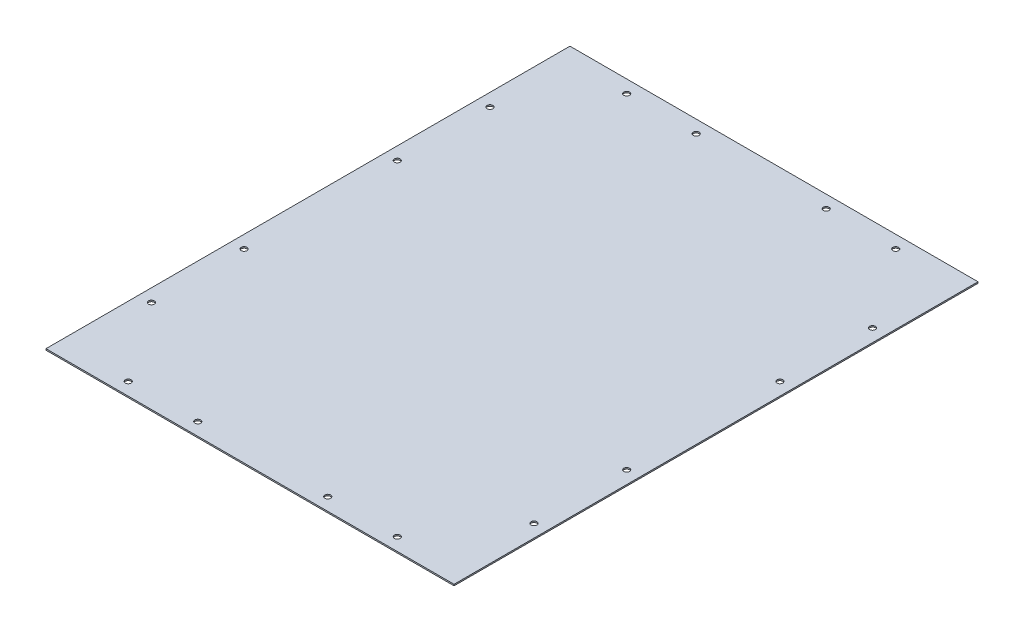
ISO-10303-21;
HEADER;
FILE_DESCRIPTION(('STEP AP214'),'2;1');
FILE_NAME('part.step','',(''),(''),'','','');
FILE_SCHEMA(('AUTOMOTIVE_DESIGN { 1 0 10303 214 1 1 1 1 }'));
ENDSEC;
DATA;
#1=APPLICATION_CONTEXT('core data for automotive mechanical design processes');
#2=APPLICATION_PROTOCOL_DEFINITION('international standard','automotive_design',2000,#1);
#3=PRODUCT_CONTEXT('',#1,'mechanical');
#4=PRODUCT('Part','Part','',(#3));
#5=PRODUCT_RELATED_PRODUCT_CATEGORY('part','',(#4));
#6=PRODUCT_DEFINITION_FORMATION('','',#4);
#7=PRODUCT_DEFINITION_CONTEXT('part definition',#1,'design');
#8=PRODUCT_DEFINITION('design','',#6,#7);
#9=PRODUCT_DEFINITION_SHAPE('','',#8);
#10=(LENGTH_UNIT() NAMED_UNIT(*) SI_UNIT(.MILLI.,.METRE.));
#11=(NAMED_UNIT(*) PLANE_ANGLE_UNIT() SI_UNIT($,.RADIAN.));
#12=(NAMED_UNIT(*) SI_UNIT($,.STERADIAN.) SOLID_ANGLE_UNIT());
#13=UNCERTAINTY_MEASURE_WITH_UNIT(LENGTH_MEASURE(1.E-05),#10,'distance_accuracy_value','');
#14=(GEOMETRIC_REPRESENTATION_CONTEXT(3) GLOBAL_UNCERTAINTY_ASSIGNED_CONTEXT((#13)) GLOBAL_UNIT_ASSIGNED_CONTEXT((#10,
#11,#12)) REPRESENTATION_CONTEXT('',''));
#15=CARTESIAN_POINT('',(0.,0.,0.));
#16=DIRECTION('',(0.,0.,1.));
#17=DIRECTION('',(1.,0.,0.));
#18=AXIS2_PLACEMENT_3D('',#15,#16,#17);
#19=CARTESIAN_POINT('',(0.,0.,0.));
#20=DIRECTION('',(-1.,0.,0.));
#21=DIRECTION('',(0.,0.,-1.));
#22=AXIS2_PLACEMENT_3D('',#19,#20,#21);
#23=PLANE('',#22);
#24=DIRECTION('',(0.,-1.,0.));
#25=VECTOR('',#24,1.);
#26=CARTESIAN_POINT('',(0.,0.,0.));
#27=LINE('',#26,#25);
#28=CARTESIAN_POINT('',(0.,1.2,0.));
#29=VERTEX_POINT('',#28);
#30=CARTESIAN_POINT('',(0.,0.,0.));
#31=VERTEX_POINT('',#30);
#32=EDGE_CURVE('E11',#29,#31,#27,.T.);
#33=ORIENTED_EDGE('',*,*,#32,.F.);
#34=DIRECTION('',(0.,0.,-1.));
#35=VECTOR('',#34,1.);
#36=CARTESIAN_POINT('',(0.,1.2,0.));
#37=LINE('',#36,#35);
#38=CARTESIAN_POINT('',(0.,1.2,-452.2));
#39=VERTEX_POINT('',#38);
#40=EDGE_CURVE('E71',#29,#39,#37,.T.);
#41=ORIENTED_EDGE('',*,*,#40,.T.);
#42=DIRECTION('',(0.,-1.,0.));
#43=VECTOR('',#42,1.);
#44=CARTESIAN_POINT('',(0.,0.,-452.2));
#45=LINE('',#44,#43);
#46=CARTESIAN_POINT('',(0.,0.,-452.2));
#47=VERTEX_POINT('',#46);
#48=EDGE_CURVE('E47',#39,#47,#45,.T.);
#49=ORIENTED_EDGE('',*,*,#48,.T.);
#50=DIRECTION('',(0.,0.,-1.));
#51=VECTOR('',#50,1.);
#52=CARTESIAN_POINT('',(0.,0.,0.));
#53=LINE('',#52,#51);
#54=EDGE_CURVE('E73',#31,#47,#53,.T.);
#55=ORIENTED_EDGE('',*,*,#54,.F.);
#56=EDGE_LOOP('',(#33,#41,#49,#55));
#57=FACE_BOUND('',#56,.T.);
#58=ADVANCED_FACE('F37',(#57),#23,.T.);
#59=CARTESIAN_POINT('',(0.,0.,-452.2));
#60=DIRECTION('',(0.,0.,-1.));
#61=DIRECTION('',(1.,0.,0.));
#62=AXIS2_PLACEMENT_3D('',#59,#60,#61);
#63=PLANE('',#62);
#64=ORIENTED_EDGE('',*,*,#48,.F.);
#65=DIRECTION('',(1.,0.,0.));
#66=VECTOR('',#65,1.);
#67=CARTESIAN_POINT('',(0.,1.2,-452.2));
#68=LINE('',#67,#66);
#69=CARTESIAN_POINT('',(352.2,1.2,-452.2));
#70=VERTEX_POINT('',#69);
#71=EDGE_CURVE('E85',#39,#70,#68,.T.);
#72=ORIENTED_EDGE('',*,*,#71,.T.);
#73=DIRECTION('',(0.,-1.,0.));
#74=VECTOR('',#73,1.);
#75=CARTESIAN_POINT('',(352.2,0.,-452.2));
#76=LINE('',#75,#74);
#77=CARTESIAN_POINT('',(352.2,0.,-452.2));
#78=VERTEX_POINT('',#77);
#79=EDGE_CURVE('E94',#70,#78,#76,.T.);
#80=ORIENTED_EDGE('',*,*,#79,.T.);
#81=DIRECTION('',(1.,0.,0.));
#82=VECTOR('',#81,1.);
#83=CARTESIAN_POINT('',(0.,0.,-452.2));
#84=LINE('',#83,#82);
#85=EDGE_CURVE('E99',#47,#78,#84,.T.);
#86=ORIENTED_EDGE('',*,*,#85,.F.);
#87=EDGE_LOOP('',(#64,#72,#80,#86));
#88=FACE_BOUND('',#87,.T.);
#89=ADVANCED_FACE('F112',(#88),#63,.T.);
#90=CARTESIAN_POINT('',(352.2,0.,0.));
#91=DIRECTION('',(-1.,0.,0.));
#92=DIRECTION('',(0.,0.,-1.));
#93=AXIS2_PLACEMENT_3D('',#90,#91,#92);
#94=PLANE('',#93);
#95=ORIENTED_EDGE('',*,*,#79,.F.);
#96=DIRECTION('',(0.,0.,-1.));
#97=VECTOR('',#96,1.);
#98=CARTESIAN_POINT('',(352.2,1.2,0.));
#99=LINE('',#98,#97);
#100=CARTESIAN_POINT('',(352.2,1.2,0.));
#101=VERTEX_POINT('',#100);
#102=EDGE_CURVE('E88',#101,#70,#99,.T.);
#103=ORIENTED_EDGE('',*,*,#102,.F.);
#104=DIRECTION('',(0.,-1.,0.));
#105=VECTOR('',#104,1.);
#106=CARTESIAN_POINT('',(352.2,0.,0.));
#107=LINE('',#106,#105);
#108=CARTESIAN_POINT('',(352.2,0.,0.));
#109=VERTEX_POINT('',#108);
#110=EDGE_CURVE('E41',#101,#109,#107,.T.);
#111=ORIENTED_EDGE('',*,*,#110,.T.);
#112=DIRECTION('',(0.,0.,-1.));
#113=VECTOR('',#112,1.);
#114=CARTESIAN_POINT('',(352.2,0.,0.));
#115=LINE('',#114,#113);
#116=EDGE_CURVE('E109',#109,#78,#115,.T.);
#117=ORIENTED_EDGE('',*,*,#116,.T.);
#118=EDGE_LOOP('',(#95,#103,#111,#117));
#119=FACE_BOUND('',#118,.T.);
#120=ADVANCED_FACE('F110',(#119),#94,.F.);
#121=CARTESIAN_POINT('',(0.,0.,0.));
#122=DIRECTION('',(0.,0.,-1.));
#123=DIRECTION('',(1.,0.,0.));
#124=AXIS2_PLACEMENT_3D('',#121,#122,#123);
#125=PLANE('',#124);
#126=DIRECTION('',(1.,0.,0.));
#127=VECTOR('',#126,1.);
#128=CARTESIAN_POINT('',(0.,1.2,0.));
#129=LINE('',#128,#127);
#130=EDGE_CURVE('E82',#29,#101,#129,.T.);
#131=ORIENTED_EDGE('',*,*,#130,.F.);
#132=ORIENTED_EDGE('',*,*,#32,.T.);
#133=DIRECTION('',(1.,0.,0.));
#134=VECTOR('',#133,1.);
#135=CARTESIAN_POINT('',(0.,0.,0.));
#136=LINE('',#135,#134);
#137=EDGE_CURVE('E105',#31,#109,#136,.T.);
#138=ORIENTED_EDGE('',*,*,#137,.T.);
#139=ORIENTED_EDGE('',*,*,#110,.F.);
#140=EDGE_LOOP('',(#131,#132,#138,#139));
#141=FACE_BOUND('',#140,.T.);
#142=ADVANCED_FACE('F39',(#141),#125,.F.);
#143=CARTESIAN_POINT('',(0.,0.,0.));
#144=DIRECTION('',(0.,-1.,0.));
#145=DIRECTION('',(0.,0.,-1.));
#146=AXIS2_PLACEMENT_3D('',#143,#144,#145);
#147=PLANE('',#146);
#148=CARTESIAN_POINT('',(11.,0.,-160.));
#149=DIRECTION('',(0.,-1.,0.));
#150=DIRECTION('',(0.,0.,-1.));
#151=AXIS2_PLACEMENT_3D('',#148,#149,#150);
#152=CIRCLE('',#151,2.5);
#153=CARTESIAN_POINT('',(11.,0.,-162.5));
#154=VERTEX_POINT('',#153);
#155=EDGE_CURVE('E90',#154,#154,#152,.T.);
#156=ORIENTED_EDGE('',*,*,#155,.F.);
#157=EDGE_LOOP('',(#156));
#158=FACE_BOUND('',#157,.T.);
#159=CARTESIAN_POINT('',(232.2,0.,-441.2));
#160=DIRECTION('',(0.,-1.,0.));
#161=DIRECTION('',(0.,0.,-1.));
#162=AXIS2_PLACEMENT_3D('',#159,#160,#161);
#163=CIRCLE('',#162,2.5);
#164=CARTESIAN_POINT('',(232.2,0.,-443.7));
#165=VERTEX_POINT('',#164);
#166=EDGE_CURVE('E287',#165,#165,#163,.T.);
#167=ORIENTED_EDGE('',*,*,#166,.F.);
#168=EDGE_LOOP('',(#167));
#169=FACE_BOUND('',#168,.T.);
#170=CARTESIAN_POINT('',(292.2,0.,-441.2));
#171=DIRECTION('',(0.,-1.,0.));
#172=DIRECTION('',(0.,0.,-1.));
#173=AXIS2_PLACEMENT_3D('',#170,#171,#172);
#174=CIRCLE('',#173,2.49999999999997);
#175=CARTESIAN_POINT('',(292.2,0.,-443.7));
#176=VERTEX_POINT('',#175);
#177=EDGE_CURVE('E284',#176,#176,#174,.T.);
#178=ORIENTED_EDGE('',*,*,#177,.F.);
#179=EDGE_LOOP('',(#178));
#180=FACE_BOUND('',#179,.T.);
#181=CARTESIAN_POINT('',(341.2,0.,-372.2));
#182=DIRECTION('',(0.,-1.,0.));
#183=DIRECTION('',(0.,0.,-1.));
#184=AXIS2_PLACEMENT_3D('',#181,#182,#183);
#185=CIRCLE('',#184,2.50000000000002);
#186=CARTESIAN_POINT('',(341.2,0.,-374.7));
#187=VERTEX_POINT('',#186);
#188=EDGE_CURVE('E281',#187,#187,#185,.T.);
#189=ORIENTED_EDGE('',*,*,#188,.F.);
#190=EDGE_LOOP('',(#189));
#191=FACE_BOUND('',#190,.T.);
#192=CARTESIAN_POINT('',(341.2,0.,-292.2));
#193=DIRECTION('',(0.,-1.,0.));
#194=DIRECTION('',(0.,0.,-1.));
#195=AXIS2_PLACEMENT_3D('',#192,#193,#194);
#196=CIRCLE('',#195,2.50000000000002);
#197=CARTESIAN_POINT('',(341.2,0.,-294.7));
#198=VERTEX_POINT('',#197);
#199=EDGE_CURVE('E278',#198,#198,#196,.T.);
#200=ORIENTED_EDGE('',*,*,#199,.F.);
#201=EDGE_LOOP('',(#200));
#202=FACE_BOUND('',#201,.T.);
#203=CARTESIAN_POINT('',(11.,0.,-292.2));
#204=DIRECTION('',(0.,-1.,0.));
#205=DIRECTION('',(0.,0.,-1.));
#206=AXIS2_PLACEMENT_3D('',#203,#204,#205);
#207=CIRCLE('',#206,2.5);
#208=CARTESIAN_POINT('',(11.,0.,-294.7));
#209=VERTEX_POINT('',#208);
#210=EDGE_CURVE('E275',#209,#209,#207,.T.);
#211=ORIENTED_EDGE('',*,*,#210,.F.);
#212=EDGE_LOOP('',(#211));
#213=FACE_BOUND('',#212,.T.);
#214=CARTESIAN_POINT('',(11.,0.,-372.2));
#215=DIRECTION('',(0.,-1.,0.));
#216=DIRECTION('',(0.,0.,-1.));
#217=AXIS2_PLACEMENT_3D('',#214,#215,#216);
#218=CIRCLE('',#217,2.5);
#219=CARTESIAN_POINT('',(11.,0.,-374.7));
#220=VERTEX_POINT('',#219);
#221=EDGE_CURVE('E272',#220,#220,#218,.T.);
#222=ORIENTED_EDGE('',*,*,#221,.F.);
#223=EDGE_LOOP('',(#222));
#224=FACE_BOUND('',#223,.T.);
#225=CARTESIAN_POINT('',(120.,0.,-441.2));
#226=DIRECTION('',(0.,-1.,0.));
#227=DIRECTION('',(0.,0.,-1.));
#228=AXIS2_PLACEMENT_3D('',#225,#226,#227);
#229=CIRCLE('',#228,2.5);
#230=CARTESIAN_POINT('',(120.,0.,-443.7));
#231=VERTEX_POINT('',#230);
#232=EDGE_CURVE('E269',#231,#231,#229,.T.);
#233=ORIENTED_EDGE('',*,*,#232,.F.);
#234=EDGE_LOOP('',(#233));
#235=FACE_BOUND('',#234,.T.);
#236=CARTESIAN_POINT('',(11.,0.,-80.));
#237=DIRECTION('',(0.,-1.,0.));
#238=DIRECTION('',(0.,0.,-1.));
#239=AXIS2_PLACEMENT_3D('',#236,#237,#238);
#240=CIRCLE('',#239,2.5);
#241=CARTESIAN_POINT('',(11.,0.,-82.5));
#242=VERTEX_POINT('',#241);
#243=EDGE_CURVE('E195',#242,#242,#240,.T.);
#244=ORIENTED_EDGE('',*,*,#243,.F.);
#245=EDGE_LOOP('',(#244));
#246=FACE_BOUND('',#245,.T.);
#247=CARTESIAN_POINT('',(60.,0.,-10.9999999999999));
#248=DIRECTION('',(0.,-1.,0.));
#249=DIRECTION('',(0.,0.,-1.));
#250=AXIS2_PLACEMENT_3D('',#247,#248,#249);
#251=CIRCLE('',#250,2.5);
#252=CARTESIAN_POINT('',(60.,0.,-13.4999999999999));
#253=VERTEX_POINT('',#252);
#254=EDGE_CURVE('E265',#253,#253,#251,.T.);
#255=ORIENTED_EDGE('',*,*,#254,.F.);
#256=EDGE_LOOP('',(#255));
#257=FACE_BOUND('',#256,.T.);
#258=CARTESIAN_POINT('',(120.,0.,-10.9999999999999));
#259=DIRECTION('',(0.,-1.,0.));
#260=DIRECTION('',(0.,0.,-1.));
#261=AXIS2_PLACEMENT_3D('',#258,#259,#260);
#262=CIRCLE('',#261,2.5);
#263=CARTESIAN_POINT('',(120.,0.,-13.4999999999999));
#264=VERTEX_POINT('',#263);
#265=EDGE_CURVE('E262',#264,#264,#262,.T.);
#266=ORIENTED_EDGE('',*,*,#265,.F.);
#267=EDGE_LOOP('',(#266));
#268=FACE_BOUND('',#267,.T.);
#269=CARTESIAN_POINT('',(232.2,0.,-10.9999999999999));
#270=DIRECTION('',(0.,-1.,0.));
#271=DIRECTION('',(0.,0.,-1.));
#272=AXIS2_PLACEMENT_3D('',#269,#270,#271);
#273=CIRCLE('',#272,2.5);
#274=CARTESIAN_POINT('',(232.2,0.,-13.4999999999999));
#275=VERTEX_POINT('',#274);
#276=EDGE_CURVE('E259',#275,#275,#273,.T.);
#277=ORIENTED_EDGE('',*,*,#276,.F.);
#278=EDGE_LOOP('',(#277));
#279=FACE_BOUND('',#278,.T.);
#280=CARTESIAN_POINT('',(292.2,0.,-10.9999999999999));
#281=DIRECTION('',(0.,-1.,0.));
#282=DIRECTION('',(0.,0.,-1.));
#283=AXIS2_PLACEMENT_3D('',#280,#281,#282);
#284=CIRCLE('',#283,2.49999999999997);
#285=CARTESIAN_POINT('',(292.2,0.,-13.4999999999999));
#286=VERTEX_POINT('',#285);
#287=EDGE_CURVE('E256',#286,#286,#284,.T.);
#288=ORIENTED_EDGE('',*,*,#287,.F.);
#289=EDGE_LOOP('',(#288));
#290=FACE_BOUND('',#289,.T.);
#291=CARTESIAN_POINT('',(341.2,0.,-80.0000000000001));
#292=DIRECTION('',(0.,-1.,0.));
#293=DIRECTION('',(0.,0.,-1.));
#294=AXIS2_PLACEMENT_3D('',#291,#292,#293);
#295=CIRCLE('',#294,2.50000000000002);
#296=CARTESIAN_POINT('',(341.2,0.,-82.5000000000001));
#297=VERTEX_POINT('',#296);
#298=EDGE_CURVE('E253',#297,#297,#295,.T.);
#299=ORIENTED_EDGE('',*,*,#298,.F.);
#300=EDGE_LOOP('',(#299));
#301=FACE_BOUND('',#300,.T.);
#302=CARTESIAN_POINT('',(341.2,0.,-160.));
#303=DIRECTION('',(0.,-1.,0.));
#304=DIRECTION('',(0.,0.,-1.));
#305=AXIS2_PLACEMENT_3D('',#302,#303,#304);
#306=CIRCLE('',#305,2.50000000000002);
#307=CARTESIAN_POINT('',(341.2,0.,-162.5));
#308=VERTEX_POINT('',#307);
#309=EDGE_CURVE('E250',#308,#308,#306,.T.);
#310=ORIENTED_EDGE('',*,*,#309,.F.);
#311=EDGE_LOOP('',(#310));
#312=FACE_BOUND('',#311,.T.);
#313=CARTESIAN_POINT('',(60.,0.,-441.2));
#314=DIRECTION('',(0.,-1.,0.));
#315=DIRECTION('',(0.,0.,-1.));
#316=AXIS2_PLACEMENT_3D('',#313,#314,#315);
#317=CIRCLE('',#316,2.5);
#318=CARTESIAN_POINT('',(60.,0.,-443.7));
#319=VERTEX_POINT('',#318);
#320=EDGE_CURVE('E247',#319,#319,#317,.T.);
#321=ORIENTED_EDGE('',*,*,#320,.F.);
#322=EDGE_LOOP('',(#321));
#323=FACE_BOUND('',#322,.T.);
#324=ORIENTED_EDGE('',*,*,#116,.F.);
#325=ORIENTED_EDGE('',*,*,#137,.F.);
#326=ORIENTED_EDGE('',*,*,#54,.T.);
#327=ORIENTED_EDGE('',*,*,#85,.T.);
#328=EDGE_LOOP('',(#324,#325,#326,#327));
#329=FACE_BOUND('',#328,.T.);
#330=ADVANCED_FACE('F111',(#158,#169,#180,#191,#202,#213,#224,#235,#246,#257,#268,#279,#290,
#301,#312,#323,#329),#147,.T.);
#331=CARTESIAN_POINT('',(0.,1.2,0.));
#332=DIRECTION('',(0.,-1.,0.));
#333=DIRECTION('',(0.,0.,-1.));
#334=AXIS2_PLACEMENT_3D('',#331,#332,#333);
#335=PLANE('',#334);
#336=CARTESIAN_POINT('',(11.,1.2,-160.));
#337=DIRECTION('',(0.,1.,0.));
#338=DIRECTION('',(0.,0.,-1.));
#339=AXIS2_PLACEMENT_3D('',#336,#337,#338);
#340=CIRCLE('',#339,2.5);
#341=CARTESIAN_POINT('',(11.,1.2,-162.5));
#342=VERTEX_POINT('',#341);
#343=EDGE_CURVE('E200',#342,#342,#340,.T.);
#344=ORIENTED_EDGE('',*,*,#343,.F.);
#345=EDGE_LOOP('',(#344));
#346=FACE_BOUND('',#345,.T.);
#347=CARTESIAN_POINT('',(232.2,1.2,-441.2));
#348=DIRECTION('',(0.,1.,0.));
#349=DIRECTION('',(0.,0.,-1.));
#350=AXIS2_PLACEMENT_3D('',#347,#348,#349);
#351=CIRCLE('',#350,2.5);
#352=CARTESIAN_POINT('',(232.2,1.2,-443.7));
#353=VERTEX_POINT('',#352);
#354=EDGE_CURVE('E204',#353,#353,#351,.T.);
#355=ORIENTED_EDGE('',*,*,#354,.F.);
#356=EDGE_LOOP('',(#355));
#357=FACE_BOUND('',#356,.T.);
#358=CARTESIAN_POINT('',(292.2,1.2,-441.2));
#359=DIRECTION('',(0.,1.,0.));
#360=DIRECTION('',(0.,0.,-1.));
#361=AXIS2_PLACEMENT_3D('',#358,#359,#360);
#362=CIRCLE('',#361,2.49999999999997);
#363=CARTESIAN_POINT('',(292.2,1.2,-443.7));
#364=VERTEX_POINT('',#363);
#365=EDGE_CURVE('E228',#364,#364,#362,.T.);
#366=ORIENTED_EDGE('',*,*,#365,.F.);
#367=EDGE_LOOP('',(#366));
#368=FACE_BOUND('',#367,.T.);
#369=CARTESIAN_POINT('',(341.2,1.2,-372.2));
#370=DIRECTION('',(0.,1.,0.));
#371=DIRECTION('',(0.,0.,-1.));
#372=AXIS2_PLACEMENT_3D('',#369,#370,#371);
#373=CIRCLE('',#372,2.50000000000002);
#374=CARTESIAN_POINT('',(341.2,1.2,-374.7));
#375=VERTEX_POINT('',#374);
#376=EDGE_CURVE('E224',#375,#375,#373,.T.);
#377=ORIENTED_EDGE('',*,*,#376,.F.);
#378=EDGE_LOOP('',(#377));
#379=FACE_BOUND('',#378,.T.);
#380=CARTESIAN_POINT('',(341.2,1.2,-292.2));
#381=DIRECTION('',(0.,1.,0.));
#382=DIRECTION('',(0.,0.,-1.));
#383=AXIS2_PLACEMENT_3D('',#380,#381,#382);
#384=CIRCLE('',#383,2.50000000000002);
#385=CARTESIAN_POINT('',(341.2,1.2,-294.7));
#386=VERTEX_POINT('',#385);
#387=EDGE_CURVE('E227',#386,#386,#384,.T.);
#388=ORIENTED_EDGE('',*,*,#387,.F.);
#389=EDGE_LOOP('',(#388));
#390=FACE_BOUND('',#389,.T.);
#391=CARTESIAN_POINT('',(11.,1.2,-292.2));
#392=DIRECTION('',(0.,1.,0.));
#393=DIRECTION('',(0.,0.,1.));
#394=AXIS2_PLACEMENT_3D('',#391,#392,#393);
#395=CIRCLE('',#394,2.5);
#396=CARTESIAN_POINT('',(11.,1.2,-289.7));
#397=VERTEX_POINT('',#396);
#398=EDGE_CURVE('E240',#397,#397,#395,.T.);
#399=ORIENTED_EDGE('',*,*,#398,.F.);
#400=EDGE_LOOP('',(#399));
#401=FACE_BOUND('',#400,.T.);
#402=CARTESIAN_POINT('',(11.,1.2,-372.2));
#403=DIRECTION('',(0.,1.,0.));
#404=DIRECTION('',(0.,0.,1.));
#405=AXIS2_PLACEMENT_3D('',#402,#403,#404);
#406=CIRCLE('',#405,2.5);
#407=CARTESIAN_POINT('',(11.,1.2,-369.7));
#408=VERTEX_POINT('',#407);
#409=EDGE_CURVE('E237',#408,#408,#406,.T.);
#410=ORIENTED_EDGE('',*,*,#409,.F.);
#411=EDGE_LOOP('',(#410));
#412=FACE_BOUND('',#411,.T.);
#413=CARTESIAN_POINT('',(120.,1.2,-441.2));
#414=DIRECTION('',(0.,1.,0.));
#415=DIRECTION('',(0.,0.,1.));
#416=AXIS2_PLACEMENT_3D('',#413,#414,#415);
#417=CIRCLE('',#416,2.5);
#418=CARTESIAN_POINT('',(120.,1.2,-438.7));
#419=VERTEX_POINT('',#418);
#420=EDGE_CURVE('E233',#419,#419,#417,.T.);
#421=ORIENTED_EDGE('',*,*,#420,.F.);
#422=EDGE_LOOP('',(#421));
#423=FACE_BOUND('',#422,.T.);
#424=CARTESIAN_POINT('',(11.,1.2,-80.));
#425=DIRECTION('',(0.,1.,0.));
#426=DIRECTION('',(0.,0.,-1.));
#427=AXIS2_PLACEMENT_3D('',#424,#425,#426);
#428=CIRCLE('',#427,2.5);
#429=CARTESIAN_POINT('',(11.,1.2,-82.5));
#430=VERTEX_POINT('',#429);
#431=EDGE_CURVE('E198',#430,#430,#428,.T.);
#432=ORIENTED_EDGE('',*,*,#431,.F.);
#433=EDGE_LOOP('',(#432));
#434=FACE_BOUND('',#433,.T.);
#435=CARTESIAN_POINT('',(60.,1.2,-10.9999999999999));
#436=DIRECTION('',(0.,1.,0.));
#437=DIRECTION('',(0.,0.,-1.));
#438=AXIS2_PLACEMENT_3D('',#435,#436,#437);
#439=CIRCLE('',#438,2.5);
#440=CARTESIAN_POINT('',(60.,1.2,-13.4999999999999));
#441=VERTEX_POINT('',#440);
#442=EDGE_CURVE('E201',#441,#441,#439,.T.);
#443=ORIENTED_EDGE('',*,*,#442,.F.);
#444=EDGE_LOOP('',(#443));
#445=FACE_BOUND('',#444,.T.);
#446=CARTESIAN_POINT('',(120.,1.2,-10.9999999999999));
#447=DIRECTION('',(0.,1.,0.));
#448=DIRECTION('',(0.,0.,-1.));
#449=AXIS2_PLACEMENT_3D('',#446,#447,#448);
#450=CIRCLE('',#449,2.5);
#451=CARTESIAN_POINT('',(120.,1.2,-13.4999999999999));
#452=VERTEX_POINT('',#451);
#453=EDGE_CURVE('E207',#452,#452,#450,.T.);
#454=ORIENTED_EDGE('',*,*,#453,.F.);
#455=EDGE_LOOP('',(#454));
#456=FACE_BOUND('',#455,.T.);
#457=CARTESIAN_POINT('',(232.2,1.2,-10.9999999999999));
#458=DIRECTION('',(0.,1.,0.));
#459=DIRECTION('',(0.,0.,1.));
#460=AXIS2_PLACEMENT_3D('',#457,#458,#459);
#461=CIRCLE('',#460,2.5);
#462=CARTESIAN_POINT('',(232.2,1.2,-8.4999999999999));
#463=VERTEX_POINT('',#462);
#464=EDGE_CURVE('E212',#463,#463,#461,.T.);
#465=ORIENTED_EDGE('',*,*,#464,.F.);
#466=EDGE_LOOP('',(#465));
#467=FACE_BOUND('',#466,.T.);
#468=CARTESIAN_POINT('',(292.2,1.2,-10.9999999999999));
#469=DIRECTION('',(0.,1.,0.));
#470=DIRECTION('',(0.,0.,1.));
#471=AXIS2_PLACEMENT_3D('',#468,#469,#470);
#472=CIRCLE('',#471,2.49999999999997);
#473=CARTESIAN_POINT('',(292.2,1.2,-8.49999999999993));
#474=VERTEX_POINT('',#473);
#475=EDGE_CURVE('E215',#474,#474,#472,.T.);
#476=ORIENTED_EDGE('',*,*,#475,.F.);
#477=EDGE_LOOP('',(#476));
#478=FACE_BOUND('',#477,.T.);
#479=CARTESIAN_POINT('',(341.2,1.2,-80.0000000000001));
#480=DIRECTION('',(0.,1.,0.));
#481=DIRECTION('',(0.,0.,1.));
#482=AXIS2_PLACEMENT_3D('',#479,#480,#481);
#483=CIRCLE('',#482,2.50000000000002);
#484=CARTESIAN_POINT('',(341.2,1.2,-77.5000000000001));
#485=VERTEX_POINT('',#484);
#486=EDGE_CURVE('E218',#485,#485,#483,.T.);
#487=ORIENTED_EDGE('',*,*,#486,.F.);
#488=EDGE_LOOP('',(#487));
#489=FACE_BOUND('',#488,.T.);
#490=CARTESIAN_POINT('',(341.2,1.2,-160.));
#491=DIRECTION('',(0.,1.,0.));
#492=DIRECTION('',(0.,0.,1.));
#493=AXIS2_PLACEMENT_3D('',#490,#491,#492);
#494=CIRCLE('',#493,2.50000000000002);
#495=CARTESIAN_POINT('',(341.2,1.2,-157.5));
#496=VERTEX_POINT('',#495);
#497=EDGE_CURVE('E221',#496,#496,#494,.T.);
#498=ORIENTED_EDGE('',*,*,#497,.F.);
#499=EDGE_LOOP('',(#498));
#500=FACE_BOUND('',#499,.T.);
#501=CARTESIAN_POINT('',(60.,1.2,-441.2));
#502=DIRECTION('',(0.,1.,0.));
#503=DIRECTION('',(0.,0.,1.));
#504=AXIS2_PLACEMENT_3D('',#501,#502,#503);
#505=CIRCLE('',#504,2.5);
#506=CARTESIAN_POINT('',(60.,1.2,-438.7));
#507=VERTEX_POINT('',#506);
#508=EDGE_CURVE('E236',#507,#507,#505,.T.);
#509=ORIENTED_EDGE('',*,*,#508,.F.);
#510=EDGE_LOOP('',(#509));
#511=FACE_BOUND('',#510,.T.);
#512=ORIENTED_EDGE('',*,*,#102,.T.);
#513=ORIENTED_EDGE('',*,*,#71,.F.);
#514=ORIENTED_EDGE('',*,*,#40,.F.);
#515=ORIENTED_EDGE('',*,*,#130,.T.);
#516=EDGE_LOOP('',(#512,#513,#514,#515));
#517=FACE_BOUND('',#516,.T.);
#518=ADVANCED_FACE('F81',(#346,#357,#368,#379,#390,#401,#412,#423,#434,#445,#456,#467,#478,#489,
#500,#511,#517),#335,.F.);
#519=CARTESIAN_POINT('',(60.,-8.8,-441.2));
#520=DIRECTION('',(0.,1.,0.));
#521=DIRECTION('',(0.,0.,1.));
#522=AXIS2_PLACEMENT_3D('',#519,#520,#521);
#523=CYLINDRICAL_SURFACE('',#522,2.5);
#524=ORIENTED_EDGE('',*,*,#320,.T.);
#525=EDGE_LOOP('',(#524));
#526=FACE_BOUND('',#525,.T.);
#527=ORIENTED_EDGE('',*,*,#508,.T.);
#528=EDGE_LOOP('',(#527));
#529=FACE_BOUND('',#528,.T.);
#530=ADVANCED_FACE('F123',(#526,#529),#523,.F.);
#531=CARTESIAN_POINT('',(341.2,-8.8,-160.));
#532=DIRECTION('',(0.,1.,0.));
#533=DIRECTION('',(0.,0.,1.));
#534=AXIS2_PLACEMENT_3D('',#531,#532,#533);
#535=CYLINDRICAL_SURFACE('',#534,2.50000000000002);
#536=ORIENTED_EDGE('',*,*,#309,.T.);
#537=EDGE_LOOP('',(#536));
#538=FACE_BOUND('',#537,.T.);
#539=ORIENTED_EDGE('',*,*,#497,.T.);
#540=EDGE_LOOP('',(#539));
#541=FACE_BOUND('',#540,.T.);
#542=ADVANCED_FACE('F130',(#538,#541),#535,.F.);
#543=CARTESIAN_POINT('',(341.2,-8.8,-80.0000000000001));
#544=DIRECTION('',(0.,1.,0.));
#545=DIRECTION('',(0.,0.,1.));
#546=AXIS2_PLACEMENT_3D('',#543,#544,#545);
#547=CYLINDRICAL_SURFACE('',#546,2.50000000000002);
#548=ORIENTED_EDGE('',*,*,#298,.T.);
#549=EDGE_LOOP('',(#548));
#550=FACE_BOUND('',#549,.T.);
#551=ORIENTED_EDGE('',*,*,#486,.T.);
#552=EDGE_LOOP('',(#551));
#553=FACE_BOUND('',#552,.T.);
#554=ADVANCED_FACE('F167',(#550,#553),#547,.F.);
#555=CARTESIAN_POINT('',(292.2,-8.8,-10.9999999999999));
#556=DIRECTION('',(0.,1.,0.));
#557=DIRECTION('',(0.,0.,1.));
#558=AXIS2_PLACEMENT_3D('',#555,#556,#557);
#559=CYLINDRICAL_SURFACE('',#558,2.49999999999997);
#560=ORIENTED_EDGE('',*,*,#287,.T.);
#561=EDGE_LOOP('',(#560));
#562=FACE_BOUND('',#561,.T.);
#563=ORIENTED_EDGE('',*,*,#475,.T.);
#564=EDGE_LOOP('',(#563));
#565=FACE_BOUND('',#564,.T.);
#566=ADVANCED_FACE('F171',(#562,#565),#559,.F.);
#567=CARTESIAN_POINT('',(232.2,-8.8,-10.9999999999999));
#568=DIRECTION('',(0.,1.,0.));
#569=DIRECTION('',(0.,0.,1.));
#570=AXIS2_PLACEMENT_3D('',#567,#568,#569);
#571=CYLINDRICAL_SURFACE('',#570,2.5);
#572=ORIENTED_EDGE('',*,*,#276,.T.);
#573=EDGE_LOOP('',(#572));
#574=FACE_BOUND('',#573,.T.);
#575=ORIENTED_EDGE('',*,*,#464,.T.);
#576=EDGE_LOOP('',(#575));
#577=FACE_BOUND('',#576,.T.);
#578=ADVANCED_FACE('F175',(#574,#577),#571,.F.);
#579=CARTESIAN_POINT('',(120.,-8.8,-10.9999999999999));
#580=DIRECTION('',(0.,1.,0.));
#581=DIRECTION('',(0.,0.,1.));
#582=AXIS2_PLACEMENT_3D('',#579,#580,#581);
#583=CYLINDRICAL_SURFACE('',#582,2.5);
#584=ORIENTED_EDGE('',*,*,#265,.T.);
#585=EDGE_LOOP('',(#584));
#586=FACE_BOUND('',#585,.T.);
#587=ORIENTED_EDGE('',*,*,#453,.T.);
#588=EDGE_LOOP('',(#587));
#589=FACE_BOUND('',#588,.T.);
#590=ADVANCED_FACE('F179',(#586,#589),#583,.F.);
#591=CARTESIAN_POINT('',(60.,-8.8,-10.9999999999999));
#592=DIRECTION('',(0.,1.,0.));
#593=DIRECTION('',(0.,0.,1.));
#594=AXIS2_PLACEMENT_3D('',#591,#592,#593);
#595=CYLINDRICAL_SURFACE('',#594,2.5);
#596=ORIENTED_EDGE('',*,*,#254,.T.);
#597=EDGE_LOOP('',(#596));
#598=FACE_BOUND('',#597,.T.);
#599=ORIENTED_EDGE('',*,*,#442,.T.);
#600=EDGE_LOOP('',(#599));
#601=FACE_BOUND('',#600,.T.);
#602=ADVANCED_FACE('F183',(#598,#601),#595,.F.);
#603=CARTESIAN_POINT('',(11.,-8.8,-80.));
#604=DIRECTION('',(0.,1.,0.));
#605=DIRECTION('',(0.,0.,1.));
#606=AXIS2_PLACEMENT_3D('',#603,#604,#605);
#607=CYLINDRICAL_SURFACE('',#606,2.5);
#608=ORIENTED_EDGE('',*,*,#243,.T.);
#609=EDGE_LOOP('',(#608));
#610=FACE_BOUND('',#609,.T.);
#611=ORIENTED_EDGE('',*,*,#431,.T.);
#612=EDGE_LOOP('',(#611));
#613=FACE_BOUND('',#612,.T.);
#614=ADVANCED_FACE('F148',(#610,#613),#607,.F.);
#615=CARTESIAN_POINT('',(120.,-8.8,-441.2));
#616=DIRECTION('',(0.,1.,0.));
#617=DIRECTION('',(0.,0.,1.));
#618=AXIS2_PLACEMENT_3D('',#615,#616,#617);
#619=CYLINDRICAL_SURFACE('',#618,2.5);
#620=ORIENTED_EDGE('',*,*,#232,.T.);
#621=EDGE_LOOP('',(#620));
#622=FACE_BOUND('',#621,.T.);
#623=ORIENTED_EDGE('',*,*,#420,.T.);
#624=EDGE_LOOP('',(#623));
#625=FACE_BOUND('',#624,.T.);
#626=ADVANCED_FACE('F144',(#622,#625),#619,.F.);
#627=CARTESIAN_POINT('',(11.,-8.8,-372.2));
#628=DIRECTION('',(0.,1.,0.));
#629=DIRECTION('',(0.,0.,1.));
#630=AXIS2_PLACEMENT_3D('',#627,#628,#629);
#631=CYLINDRICAL_SURFACE('',#630,2.5);
#632=ORIENTED_EDGE('',*,*,#221,.T.);
#633=EDGE_LOOP('',(#632));
#634=FACE_BOUND('',#633,.T.);
#635=ORIENTED_EDGE('',*,*,#409,.T.);
#636=EDGE_LOOP('',(#635));
#637=FACE_BOUND('',#636,.T.);
#638=ADVANCED_FACE('F140',(#634,#637),#631,.F.);
#639=CARTESIAN_POINT('',(11.,-8.8,-292.2));
#640=DIRECTION('',(0.,1.,0.));
#641=DIRECTION('',(0.,0.,1.));
#642=AXIS2_PLACEMENT_3D('',#639,#640,#641);
#643=CYLINDRICAL_SURFACE('',#642,2.5);
#644=ORIENTED_EDGE('',*,*,#210,.T.);
#645=EDGE_LOOP('',(#644));
#646=FACE_BOUND('',#645,.T.);
#647=ORIENTED_EDGE('',*,*,#398,.T.);
#648=EDGE_LOOP('',(#647));
#649=FACE_BOUND('',#648,.T.);
#650=ADVANCED_FACE('F136',(#646,#649),#643,.F.);
#651=CARTESIAN_POINT('',(341.2,-8.8,-292.2));
#652=DIRECTION('',(0.,1.,0.));
#653=DIRECTION('',(0.,0.,1.));
#654=AXIS2_PLACEMENT_3D('',#651,#652,#653);
#655=CYLINDRICAL_SURFACE('',#654,2.50000000000002);
#656=ORIENTED_EDGE('',*,*,#199,.T.);
#657=EDGE_LOOP('',(#656));
#658=FACE_BOUND('',#657,.T.);
#659=ORIENTED_EDGE('',*,*,#387,.T.);
#660=EDGE_LOOP('',(#659));
#661=FACE_BOUND('',#660,.T.);
#662=ADVANCED_FACE('F132',(#658,#661),#655,.F.);
#663=CARTESIAN_POINT('',(341.2,-8.8,-372.2));
#664=DIRECTION('',(0.,1.,0.));
#665=DIRECTION('',(0.,0.,1.));
#666=AXIS2_PLACEMENT_3D('',#663,#664,#665);
#667=CYLINDRICAL_SURFACE('',#666,2.50000000000002);
#668=ORIENTED_EDGE('',*,*,#188,.T.);
#669=EDGE_LOOP('',(#668));
#670=FACE_BOUND('',#669,.T.);
#671=ORIENTED_EDGE('',*,*,#376,.T.);
#672=EDGE_LOOP('',(#671));
#673=FACE_BOUND('',#672,.T.);
#674=ADVANCED_FACE('F135',(#670,#673),#667,.F.);
#675=CARTESIAN_POINT('',(292.2,-8.8,-441.2));
#676=DIRECTION('',(0.,1.,0.));
#677=DIRECTION('',(0.,0.,1.));
#678=AXIS2_PLACEMENT_3D('',#675,#676,#677);
#679=CYLINDRICAL_SURFACE('',#678,2.49999999999997);
#680=ORIENTED_EDGE('',*,*,#177,.T.);
#681=EDGE_LOOP('',(#680));
#682=FACE_BOUND('',#681,.T.);
#683=ORIENTED_EDGE('',*,*,#365,.T.);
#684=EDGE_LOOP('',(#683));
#685=FACE_BOUND('',#684,.T.);
#686=ADVANCED_FACE('F157',(#682,#685),#679,.F.);
#687=CARTESIAN_POINT('',(232.2,-8.8,-441.2));
#688=DIRECTION('',(0.,1.,0.));
#689=DIRECTION('',(0.,0.,1.));
#690=AXIS2_PLACEMENT_3D('',#687,#688,#689);
#691=CYLINDRICAL_SURFACE('',#690,2.5);
#692=ORIENTED_EDGE('',*,*,#166,.T.);
#693=EDGE_LOOP('',(#692));
#694=FACE_BOUND('',#693,.T.);
#695=ORIENTED_EDGE('',*,*,#354,.T.);
#696=EDGE_LOOP('',(#695));
#697=FACE_BOUND('',#696,.T.);
#698=ADVANCED_FACE('F153',(#694,#697),#691,.F.);
#699=CARTESIAN_POINT('',(11.,-8.8,-160.));
#700=DIRECTION('',(0.,1.,0.));
#701=DIRECTION('',(0.,0.,1.));
#702=AXIS2_PLACEMENT_3D('',#699,#700,#701);
#703=CYLINDRICAL_SURFACE('',#702,2.5);
#704=ORIENTED_EDGE('',*,*,#155,.T.);
#705=EDGE_LOOP('',(#704));
#706=FACE_BOUND('',#705,.T.);
#707=ORIENTED_EDGE('',*,*,#343,.T.);
#708=EDGE_LOOP('',(#707));
#709=FACE_BOUND('',#708,.T.);
#710=ADVANCED_FACE('F150',(#706,#709),#703,.F.);
#711=CLOSED_SHELL('',(#58,#89,#120,#142,#330,#518,#530,#542,#554,#566,#578,#590,#602,#614,#626,
#638,#650,#662,#674,#686,#698,#710));
#712=MANIFOLD_SOLID_BREP('B2',#711);
#713=ADVANCED_BREP_SHAPE_REPRESENTATION('',(#18,#712),#14);
#714=SHAPE_DEFINITION_REPRESENTATION(#9,#713);
ENDSEC;
END-ISO-10303-21;
